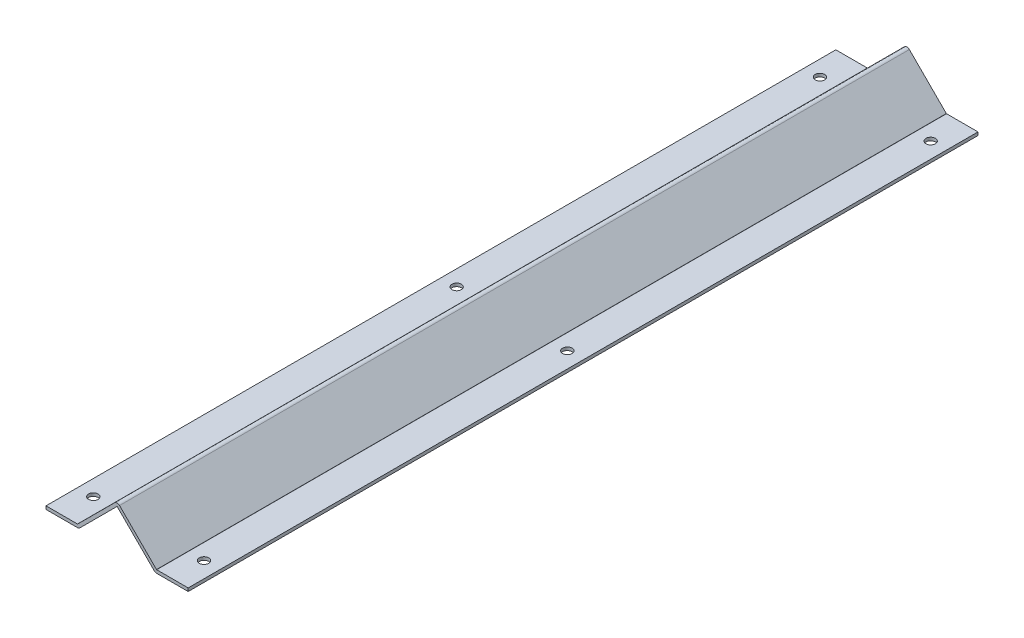
ISO-10303-21;
HEADER;
FILE_DESCRIPTION(('STEP AP214'),'2;1');
FILE_NAME('part.step','',(''),(''),'','','');
FILE_SCHEMA(('AUTOMOTIVE_DESIGN { 1 0 10303 214 1 1 1 1 }'));
ENDSEC;
DATA;
#1=APPLICATION_CONTEXT('core data for automotive mechanical design processes');
#2=APPLICATION_PROTOCOL_DEFINITION('international standard','automotive_design',2000,#1);
#3=PRODUCT_CONTEXT('',#1,'mechanical');
#4=PRODUCT('Part','Part','',(#3));
#5=PRODUCT_RELATED_PRODUCT_CATEGORY('part','',(#4));
#6=PRODUCT_DEFINITION_FORMATION('','',#4);
#7=PRODUCT_DEFINITION_CONTEXT('part definition',#1,'design');
#8=PRODUCT_DEFINITION('design','',#6,#7);
#9=PRODUCT_DEFINITION_SHAPE('','',#8);
#10=(LENGTH_UNIT() NAMED_UNIT(*) SI_UNIT(.MILLI.,.METRE.));
#11=(NAMED_UNIT(*) PLANE_ANGLE_UNIT() SI_UNIT($,.RADIAN.));
#12=(NAMED_UNIT(*) SI_UNIT($,.STERADIAN.) SOLID_ANGLE_UNIT());
#13=UNCERTAINTY_MEASURE_WITH_UNIT(LENGTH_MEASURE(1.E-05),#10,'distance_accuracy_value','');
#14=(GEOMETRIC_REPRESENTATION_CONTEXT(3) GLOBAL_UNCERTAINTY_ASSIGNED_CONTEXT((#13)) GLOBAL_UNIT_ASSIGNED_CONTEXT((#10,
#11,#12)) REPRESENTATION_CONTEXT('',''));
#15=CARTESIAN_POINT('',(0.,0.,0.));
#16=DIRECTION('',(0.,0.,1.));
#17=DIRECTION('',(1.,0.,0.));
#18=AXIS2_PLACEMENT_3D('',#15,#16,#17);
#19=CARTESIAN_POINT('',(0.,0.,500.));
#20=DIRECTION('',(1.,0.,0.));
#21=DIRECTION('',(0.,0.,-1.));
#22=AXIS2_PLACEMENT_3D('',#19,#20,#21);
#23=PLANE('',#22);
#24=DIRECTION('',(0.,-1.,0.));
#25=VECTOR('',#24,1.);
#26=CARTESIAN_POINT('',(0.,0.,0.));
#27=LINE('',#26,#25);
#28=CARTESIAN_POINT('',(0.,0.,0.));
#29=VERTEX_POINT('',#28);
#30=CARTESIAN_POINT('',(0.,-2.,0.));
#31=VERTEX_POINT('',#30);
#32=EDGE_CURVE('E178',#29,#31,#27,.T.);
#33=ORIENTED_EDGE('',*,*,#32,.T.);
#34=DIRECTION('',(0.,0.,-1.));
#35=VECTOR('',#34,1.);
#36=CARTESIAN_POINT('',(0.,-2.,500.));
#37=LINE('',#36,#35);
#38=CARTESIAN_POINT('',(0.,-2.,500.));
#39=VERTEX_POINT('',#38);
#40=EDGE_CURVE('E11',#39,#31,#37,.T.);
#41=ORIENTED_EDGE('',*,*,#40,.F.);
#42=DIRECTION('',(0.,-1.,0.));
#43=VECTOR('',#42,1.);
#44=CARTESIAN_POINT('',(0.,0.,500.));
#45=LINE('',#44,#43);
#46=CARTESIAN_POINT('',(0.,0.,500.));
#47=VERTEX_POINT('',#46);
#48=EDGE_CURVE('E209',#47,#39,#45,.T.);
#49=ORIENTED_EDGE('',*,*,#48,.F.);
#50=DIRECTION('',(0.,0.,-1.));
#51=VECTOR('',#50,1.);
#52=CARTESIAN_POINT('',(0.,0.,500.));
#53=LINE('',#52,#51);
#54=EDGE_CURVE('E174',#47,#29,#53,.T.);
#55=ORIENTED_EDGE('',*,*,#54,.T.);
#56=EDGE_LOOP('',(#33,#41,#49,#55));
#57=FACE_BOUND('',#56,.T.);
#58=ADVANCED_FACE('F34',(#57),#23,.F.);
#59=CARTESIAN_POINT('',(0.,-2.,500.));
#60=DIRECTION('',(0.,1.,0.));
#61=DIRECTION('',(0.,0.,1.));
#62=AXIS2_PLACEMENT_3D('',#59,#60,#61);
#63=PLANE('',#62);
#64=CARTESIAN_POINT('',(9.95857864376269,-2.,480.));
#65=DIRECTION('',(0.,1.,0.));
#66=DIRECTION('',(0.,0.,1.));
#67=AXIS2_PLACEMENT_3D('',#64,#65,#66);
#68=CIRCLE('',#67,3.);
#69=CARTESIAN_POINT('',(9.95857864376269,-2.,483.));
#70=VERTEX_POINT('',#69);
#71=EDGE_CURVE('E477',#70,#70,#68,.F.);
#72=ORIENTED_EDGE('',*,*,#71,.F.);
#73=EDGE_LOOP('',(#72));
#74=FACE_BOUND('',#73,.T.);
#75=CARTESIAN_POINT('',(9.95857864376269,-2.,250.));
#76=DIRECTION('',(0.,1.,0.));
#77=DIRECTION('',(0.,0.,1.));
#78=AXIS2_PLACEMENT_3D('',#75,#76,#77);
#79=CIRCLE('',#78,3.);
#80=CARTESIAN_POINT('',(9.95857864376269,-2.,253.));
#81=VERTEX_POINT('',#80);
#82=EDGE_CURVE('E475',#81,#81,#79,.F.);
#83=ORIENTED_EDGE('',*,*,#82,.F.);
#84=EDGE_LOOP('',(#83));
#85=FACE_BOUND('',#84,.T.);
#86=CARTESIAN_POINT('',(9.95857864376269,-2.,20.));
#87=DIRECTION('',(0.,1.,0.));
#88=DIRECTION('',(0.,0.,1.));
#89=AXIS2_PLACEMENT_3D('',#86,#87,#88);
#90=CIRCLE('',#89,3.);
#91=CARTESIAN_POINT('',(9.95857864376269,-2.,23.));
#92=VERTEX_POINT('',#91);
#93=EDGE_CURVE('E182',#92,#92,#90,.F.);
#94=ORIENTED_EDGE('',*,*,#93,.F.);
#95=EDGE_LOOP('',(#94));
#96=FACE_BOUND('',#95,.T.);
#97=DIRECTION('',(1.,0.,0.));
#98=VECTOR('',#97,1.);
#99=CARTESIAN_POINT('',(0.,-2.,0.));
#100=LINE('',#99,#98);
#101=CARTESIAN_POINT('',(19.9171572875254,-2.,0.));
#102=VERTEX_POINT('',#101);
#103=EDGE_CURVE('E181',#31,#102,#100,.T.);
#104=ORIENTED_EDGE('',*,*,#103,.T.);
#105=DIRECTION('',(0.,0.,-1.));
#106=VECTOR('',#105,1.);
#107=CARTESIAN_POINT('',(19.9171572875254,-2.,500.));
#108=LINE('',#107,#106);
#109=CARTESIAN_POINT('',(19.9171572875254,-2.,500.));
#110=VERTEX_POINT('',#109);
#111=EDGE_CURVE('E42',#110,#102,#108,.T.);
#112=ORIENTED_EDGE('',*,*,#111,.F.);
#113=DIRECTION('',(1.,0.,0.));
#114=VECTOR('',#113,1.);
#115=CARTESIAN_POINT('',(0.,-2.,500.));
#116=LINE('',#115,#114);
#117=EDGE_CURVE('E117',#39,#110,#116,.T.);
#118=ORIENTED_EDGE('',*,*,#117,.F.);
#119=ORIENTED_EDGE('',*,*,#40,.T.);
#120=EDGE_LOOP('',(#104,#112,#118,#119));
#121=FACE_BOUND('',#120,.T.);
#122=ADVANCED_FACE('F310',(#74,#85,#96,#121),#63,.F.);
#123=CARTESIAN_POINT('',(19.9171572875254,0.2,500.));
#124=DIRECTION('',(0.,0.,-1.));
#125=DIRECTION('',(-1.,0.,0.));
#126=AXIS2_PLACEMENT_3D('',#123,#124,#125);
#127=CYLINDRICAL_SURFACE('',#126,2.2);
#128=CARTESIAN_POINT('',(19.9171572875254,0.2,0.));
#129=DIRECTION('',(0.,0.,1.));
#130=DIRECTION('',(-1.,0.,0.));
#131=AXIS2_PLACEMENT_3D('',#128,#129,#130);
#132=CIRCLE('',#131,2.2);
#133=CARTESIAN_POINT('',(21.4727922061358,-1.35563491861041,0.));
#134=VERTEX_POINT('',#133);
#135=EDGE_CURVE('E184',#102,#134,#132,.T.);
#136=ORIENTED_EDGE('',*,*,#135,.T.);
#137=DIRECTION('',(0.,0.,-1.));
#138=VECTOR('',#137,1.);
#139=CARTESIAN_POINT('',(21.4727922061358,-1.35563491861041,500.));
#140=LINE('',#139,#138);
#141=CARTESIAN_POINT('',(21.4727922061358,-1.35563491861041,500.));
#142=VERTEX_POINT('',#141);
#143=EDGE_CURVE('E240',#142,#134,#140,.T.);
#144=ORIENTED_EDGE('',*,*,#143,.F.);
#145=CARTESIAN_POINT('',(19.9171572875254,0.2,500.));
#146=DIRECTION('',(0.,0.,1.));
#147=DIRECTION('',(-1.,0.,0.));
#148=AXIS2_PLACEMENT_3D('',#145,#146,#147);
#149=CIRCLE('',#148,2.2);
#150=EDGE_CURVE('E248',#110,#142,#149,.T.);
#151=ORIENTED_EDGE('',*,*,#150,.F.);
#152=ORIENTED_EDGE('',*,*,#111,.T.);
#153=EDGE_LOOP('',(#136,#144,#151,#152));
#154=FACE_BOUND('',#153,.T.);
#155=ADVANCED_FACE('F246',(#154),#127,.T.);
#156=CARTESIAN_POINT('',(21.4727922061358,-1.35563491861041,500.));
#157=DIRECTION('',(-0.707106781186548,0.707106781186547,0.));
#158=DIRECTION('',(-0.707106781186547,-0.707106781186548,0.));
#159=AXIS2_PLACEMENT_3D('',#156,#157,#158);
#160=PLANE('',#159);
#161=DIRECTION('',(0.707106781186548,0.707106781186548,0.));
#162=VECTOR('',#161,1.);
#163=CARTESIAN_POINT('',(21.4727922061358,-1.35563491861041,0.));
#164=LINE('',#163,#162);
#165=CARTESIAN_POINT('',(44.8585786437626,22.0301515190165,0.));
#166=VERTEX_POINT('',#165);
#167=EDGE_CURVE('E186',#134,#166,#164,.T.);
#168=ORIENTED_EDGE('',*,*,#167,.T.);
#169=DIRECTION('',(0.,0.,-1.));
#170=VECTOR('',#169,1.);
#171=CARTESIAN_POINT('',(44.8585786437626,22.0301515190165,500.));
#172=LINE('',#171,#170);
#173=CARTESIAN_POINT('',(44.8585786437626,22.0301515190165,500.));
#174=VERTEX_POINT('',#173);
#175=EDGE_CURVE('E237',#174,#166,#172,.T.);
#176=ORIENTED_EDGE('',*,*,#175,.F.);
#177=DIRECTION('',(0.707106781186548,0.707106781186548,0.));
#178=VECTOR('',#177,1.);
#179=CARTESIAN_POINT('',(21.4727922061358,-1.35563491861041,500.));
#180=LINE('',#179,#178);
#181=EDGE_CURVE('E266',#142,#174,#180,.T.);
#182=ORIENTED_EDGE('',*,*,#181,.F.);
#183=ORIENTED_EDGE('',*,*,#143,.T.);
#184=EDGE_LOOP('',(#168,#176,#182,#183));
#185=FACE_BOUND('',#184,.T.);
#186=ADVANCED_FACE('F257',(#185),#160,.F.);
#187=CARTESIAN_POINT('',(44.9999999999999,21.8887301627792,500.));
#188=DIRECTION('',(0.,0.,-1.));
#189=DIRECTION('',(-1.,0.,0.));
#190=AXIS2_PLACEMENT_3D('',#187,#188,#189);
#191=CYLINDRICAL_SURFACE('',#190,0.199999999999971);
#192=CARTESIAN_POINT('',(44.9999999999999,21.8887301627792,0.));
#193=DIRECTION('',(0.,0.,-1.));
#194=DIRECTION('',(1.,0.,0.));
#195=AXIS2_PLACEMENT_3D('',#192,#193,#194);
#196=CIRCLE('',#195,0.199999999999971);
#197=CARTESIAN_POINT('',(45.1414213562372,22.0301515190165,0.));
#198=VERTEX_POINT('',#197);
#199=EDGE_CURVE('E188',#166,#198,#196,.T.);
#200=ORIENTED_EDGE('',*,*,#199,.T.);
#201=DIRECTION('',(0.,0.,-1.));
#202=VECTOR('',#201,1.);
#203=CARTESIAN_POINT('',(45.1414213562372,22.0301515190165,500.));
#204=LINE('',#203,#202);
#205=CARTESIAN_POINT('',(45.1414213562372,22.0301515190165,500.));
#206=VERTEX_POINT('',#205);
#207=EDGE_CURVE('E234',#206,#198,#204,.T.);
#208=ORIENTED_EDGE('',*,*,#207,.F.);
#209=CARTESIAN_POINT('',(44.9999999999999,21.8887301627792,500.));
#210=DIRECTION('',(0.,0.,-1.));
#211=DIRECTION('',(1.,0.,0.));
#212=AXIS2_PLACEMENT_3D('',#209,#210,#211);
#213=CIRCLE('',#212,0.199999999999971);
#214=EDGE_CURVE('E263',#174,#206,#213,.T.);
#215=ORIENTED_EDGE('',*,*,#214,.F.);
#216=ORIENTED_EDGE('',*,*,#175,.T.);
#217=EDGE_LOOP('',(#200,#208,#215,#216));
#218=FACE_BOUND('',#217,.T.);
#219=ADVANCED_FACE('F261',(#218),#191,.F.);
#220=CARTESIAN_POINT('',(45.1414213562372,22.0301515190165,500.));
#221=DIRECTION('',(0.707106781186547,0.707106781186548,0.));
#222=DIRECTION('',(-0.707106781186548,0.707106781186547,0.));
#223=AXIS2_PLACEMENT_3D('',#220,#221,#222);
#224=PLANE('',#223);
#225=DIRECTION('',(0.707106781186548,-0.707106781186548,0.));
#226=VECTOR('',#225,1.);
#227=CARTESIAN_POINT('',(45.1414213562372,22.0301515190165,0.));
#228=LINE('',#227,#226);
#229=CARTESIAN_POINT('',(68.5272077938641,-1.35563491861039,0.));
#230=VERTEX_POINT('',#229);
#231=EDGE_CURVE('E190',#198,#230,#228,.T.);
#232=ORIENTED_EDGE('',*,*,#231,.T.);
#233=DIRECTION('',(0.,0.,-1.));
#234=VECTOR('',#233,1.);
#235=CARTESIAN_POINT('',(68.5272077938641,-1.35563491861039,500.));
#236=LINE('',#235,#234);
#237=CARTESIAN_POINT('',(68.5272077938641,-1.35563491861039,500.));
#238=VERTEX_POINT('',#237);
#239=EDGE_CURVE('E231',#238,#230,#236,.T.);
#240=ORIENTED_EDGE('',*,*,#239,.F.);
#241=DIRECTION('',(0.707106781186548,-0.707106781186548,0.));
#242=VECTOR('',#241,1.);
#243=CARTESIAN_POINT('',(45.1414213562372,22.0301515190165,500.));
#244=LINE('',#243,#242);
#245=EDGE_CURVE('E265',#206,#238,#244,.T.);
#246=ORIENTED_EDGE('',*,*,#245,.F.);
#247=ORIENTED_EDGE('',*,*,#207,.T.);
#248=EDGE_LOOP('',(#232,#240,#246,#247));
#249=FACE_BOUND('',#248,.T.);
#250=ADVANCED_FACE('F326',(#249),#224,.F.);
#251=CARTESIAN_POINT('',(70.0828427124744,0.199999999999999,500.));
#252=DIRECTION('',(0.,0.,-1.));
#253=DIRECTION('',(-1.,0.,0.));
#254=AXIS2_PLACEMENT_3D('',#251,#252,#253);
#255=CYLINDRICAL_SURFACE('',#254,2.19999999999997);
#256=CARTESIAN_POINT('',(70.0828427124744,0.199999999999999,0.));
#257=DIRECTION('',(0.,0.,1.));
#258=DIRECTION('',(1.,0.,0.));
#259=AXIS2_PLACEMENT_3D('',#256,#257,#258);
#260=CIRCLE('',#259,2.19999999999997);
#261=CARTESIAN_POINT('',(70.0828427124744,-2.,0.));
#262=VERTEX_POINT('',#261);
#263=EDGE_CURVE('E192',#230,#262,#260,.T.);
#264=ORIENTED_EDGE('',*,*,#263,.T.);
#265=DIRECTION('',(0.,0.,-1.));
#266=VECTOR('',#265,1.);
#267=CARTESIAN_POINT('',(70.0828427124744,-2.,500.));
#268=LINE('',#267,#266);
#269=CARTESIAN_POINT('',(70.0828427124744,-2.,500.));
#270=VERTEX_POINT('',#269);
#271=EDGE_CURVE('E228',#270,#262,#268,.T.);
#272=ORIENTED_EDGE('',*,*,#271,.F.);
#273=CARTESIAN_POINT('',(70.0828427124744,0.199999999999999,500.));
#274=DIRECTION('',(0.,0.,1.));
#275=DIRECTION('',(1.,0.,0.));
#276=AXIS2_PLACEMENT_3D('',#273,#274,#275);
#277=CIRCLE('',#276,2.19999999999997);
#278=EDGE_CURVE('E268',#238,#270,#277,.T.);
#279=ORIENTED_EDGE('',*,*,#278,.F.);
#280=ORIENTED_EDGE('',*,*,#239,.T.);
#281=EDGE_LOOP('',(#264,#272,#279,#280));
#282=FACE_BOUND('',#281,.T.);
#283=ADVANCED_FACE('F329',(#282),#255,.T.);
#284=CARTESIAN_POINT('',(70.0828427124744,-2.,500.));
#285=DIRECTION('',(0.,1.,0.));
#286=DIRECTION('',(-1.,0.,0.));
#287=AXIS2_PLACEMENT_3D('',#284,#285,#286);
#288=PLANE('',#287);
#289=CARTESIAN_POINT('',(80.0414213562371,-2.,250.));
#290=DIRECTION('',(0.,1.,0.));
#291=DIRECTION('',(-1.,0.,0.));
#292=AXIS2_PLACEMENT_3D('',#289,#290,#291);
#293=CIRCLE('',#292,3.00000000000001);
#294=CARTESIAN_POINT('',(77.0414213562371,-2.,250.));
#295=VERTEX_POINT('',#294);
#296=EDGE_CURVE('E471',#295,#295,#293,.F.);
#297=ORIENTED_EDGE('',*,*,#296,.F.);
#298=EDGE_LOOP('',(#297));
#299=FACE_BOUND('',#298,.T.);
#300=CARTESIAN_POINT('',(80.0414213562371,-2.,20.));
#301=DIRECTION('',(0.,1.,0.));
#302=DIRECTION('',(-1.,0.,0.));
#303=AXIS2_PLACEMENT_3D('',#300,#301,#302);
#304=CIRCLE('',#303,3.00000000000001);
#305=CARTESIAN_POINT('',(77.0414213562371,-2.,20.));
#306=VERTEX_POINT('',#305);
#307=EDGE_CURVE('E490',#306,#306,#304,.F.);
#308=ORIENTED_EDGE('',*,*,#307,.F.);
#309=EDGE_LOOP('',(#308));
#310=FACE_BOUND('',#309,.T.);
#311=CARTESIAN_POINT('',(80.0414213562371,-2.,480.));
#312=DIRECTION('',(0.,1.,0.));
#313=DIRECTION('',(-1.,0.,0.));
#314=AXIS2_PLACEMENT_3D('',#311,#312,#313);
#315=CIRCLE('',#314,3.00000000000001);
#316=CARTESIAN_POINT('',(77.0414213562371,-2.,480.));
#317=VERTEX_POINT('',#316);
#318=EDGE_CURVE('E484',#317,#317,#315,.F.);
#319=ORIENTED_EDGE('',*,*,#318,.F.);
#320=EDGE_LOOP('',(#319));
#321=FACE_BOUND('',#320,.T.);
#322=DIRECTION('',(1.,0.,0.));
#323=VECTOR('',#322,1.);
#324=CARTESIAN_POINT('',(70.0828427124744,-2.,0.));
#325=LINE('',#324,#323);
#326=CARTESIAN_POINT('',(89.9999999999998,-2.,0.));
#327=VERTEX_POINT('',#326);
#328=EDGE_CURVE('E194',#262,#327,#325,.T.);
#329=ORIENTED_EDGE('',*,*,#328,.T.);
#330=DIRECTION('',(0.,0.,-1.));
#331=VECTOR('',#330,1.);
#332=CARTESIAN_POINT('',(89.9999999999998,-2.,500.));
#333=LINE('',#332,#331);
#334=CARTESIAN_POINT('',(89.9999999999998,-2.,500.));
#335=VERTEX_POINT('',#334);
#336=EDGE_CURVE('E225',#335,#327,#333,.T.);
#337=ORIENTED_EDGE('',*,*,#336,.F.);
#338=DIRECTION('',(1.,0.,0.));
#339=VECTOR('',#338,1.);
#340=CARTESIAN_POINT('',(70.0828427124744,-2.,500.));
#341=LINE('',#340,#339);
#342=EDGE_CURVE('E274',#270,#335,#341,.T.);
#343=ORIENTED_EDGE('',*,*,#342,.F.);
#344=ORIENTED_EDGE('',*,*,#271,.T.);
#345=EDGE_LOOP('',(#329,#337,#343,#344));
#346=FACE_BOUND('',#345,.T.);
#347=ADVANCED_FACE('F333',(#299,#310,#321,#346),#288,.F.);
#348=CARTESIAN_POINT('',(89.9999999999998,0.,500.));
#349=DIRECTION('',(-1.,0.,0.));
#350=DIRECTION('',(0.,0.,1.));
#351=AXIS2_PLACEMENT_3D('',#348,#349,#350);
#352=PLANE('',#351);
#353=DIRECTION('',(0.,1.,0.));
#354=VECTOR('',#353,1.);
#355=CARTESIAN_POINT('',(89.9999999999998,0.,0.));
#356=LINE('',#355,#354);
#357=CARTESIAN_POINT('',(89.9999999999998,0.,0.));
#358=VERTEX_POINT('',#357);
#359=EDGE_CURVE('E196',#327,#358,#356,.T.);
#360=ORIENTED_EDGE('',*,*,#359,.T.);
#361=DIRECTION('',(0.,0.,-1.));
#362=VECTOR('',#361,1.);
#363=CARTESIAN_POINT('',(89.9999999999998,0.,500.));
#364=LINE('',#363,#362);
#365=CARTESIAN_POINT('',(89.9999999999998,0.,500.));
#366=VERTEX_POINT('',#365);
#367=EDGE_CURVE('E222',#366,#358,#364,.T.);
#368=ORIENTED_EDGE('',*,*,#367,.F.);
#369=DIRECTION('',(0.,1.,0.));
#370=VECTOR('',#369,1.);
#371=CARTESIAN_POINT('',(89.9999999999998,0.,500.));
#372=LINE('',#371,#370);
#373=EDGE_CURVE('E276',#335,#366,#372,.T.);
#374=ORIENTED_EDGE('',*,*,#373,.F.);
#375=ORIENTED_EDGE('',*,*,#336,.T.);
#376=EDGE_LOOP('',(#360,#368,#374,#375));
#377=FACE_BOUND('',#376,.T.);
#378=ADVANCED_FACE('F337',(#377),#352,.F.);
#379=CARTESIAN_POINT('',(70.0828427124744,0.,500.));
#380=DIRECTION('',(0.,-1.,0.));
#381=DIRECTION('',(0.,0.,-1.));
#382=AXIS2_PLACEMENT_3D('',#379,#380,#381);
#383=PLANE('',#382);
#384=CARTESIAN_POINT('',(80.0414213562371,0.,250.));
#385=DIRECTION('',(0.,1.,0.));
#386=DIRECTION('',(0.,0.,1.));
#387=AXIS2_PLACEMENT_3D('',#384,#385,#386);
#388=CIRCLE('',#387,3.00000000000001);
#389=CARTESIAN_POINT('',(80.0414213562371,0.,253.));
#390=VERTEX_POINT('',#389);
#391=EDGE_CURVE('E468',#390,#390,#388,.T.);
#392=ORIENTED_EDGE('',*,*,#391,.F.);
#393=EDGE_LOOP('',(#392));
#394=FACE_BOUND('',#393,.T.);
#395=CARTESIAN_POINT('',(80.0414213562371,0.,20.));
#396=DIRECTION('',(0.,1.,0.));
#397=DIRECTION('',(0.,0.,1.));
#398=AXIS2_PLACEMENT_3D('',#395,#396,#397);
#399=CIRCLE('',#398,3.00000000000001);
#400=CARTESIAN_POINT('',(80.0414213562371,0.,23.));
#401=VERTEX_POINT('',#400);
#402=EDGE_CURVE('E487',#401,#401,#399,.T.);
#403=ORIENTED_EDGE('',*,*,#402,.F.);
#404=EDGE_LOOP('',(#403));
#405=FACE_BOUND('',#404,.T.);
#406=CARTESIAN_POINT('',(80.0414213562371,0.,480.));
#407=DIRECTION('',(0.,1.,0.));
#408=DIRECTION('',(0.,0.,1.));
#409=AXIS2_PLACEMENT_3D('',#406,#407,#408);
#410=CIRCLE('',#409,3.00000000000001);
#411=CARTESIAN_POINT('',(80.0414213562371,0.,483.));
#412=VERTEX_POINT('',#411);
#413=EDGE_CURVE('E531',#412,#412,#410,.T.);
#414=ORIENTED_EDGE('',*,*,#413,.F.);
#415=EDGE_LOOP('',(#414));
#416=FACE_BOUND('',#415,.T.);
#417=DIRECTION('',(-1.,0.,0.));
#418=VECTOR('',#417,1.);
#419=CARTESIAN_POINT('',(70.0828427124744,0.,0.));
#420=LINE('',#419,#418);
#421=CARTESIAN_POINT('',(70.0828427124744,0.,0.));
#422=VERTEX_POINT('',#421);
#423=EDGE_CURVE('E198',#358,#422,#420,.T.);
#424=ORIENTED_EDGE('',*,*,#423,.T.);
#425=DIRECTION('',(0.,0.,-1.));
#426=VECTOR('',#425,1.);
#427=CARTESIAN_POINT('',(70.0828427124744,0.,500.));
#428=LINE('',#427,#426);
#429=CARTESIAN_POINT('',(70.0828427124744,0.,500.));
#430=VERTEX_POINT('',#429);
#431=EDGE_CURVE('E219',#430,#422,#428,.T.);
#432=ORIENTED_EDGE('',*,*,#431,.F.);
#433=DIRECTION('',(-1.,0.,0.));
#434=VECTOR('',#433,1.);
#435=CARTESIAN_POINT('',(70.0828427124744,0.,500.));
#436=LINE('',#435,#434);
#437=EDGE_CURVE('E278',#366,#430,#436,.T.);
#438=ORIENTED_EDGE('',*,*,#437,.F.);
#439=ORIENTED_EDGE('',*,*,#367,.T.);
#440=EDGE_LOOP('',(#424,#432,#438,#439));
#441=FACE_BOUND('',#440,.T.);
#442=ADVANCED_FACE('F341',(#394,#405,#416,#441),#383,.F.);
#443=CARTESIAN_POINT('',(70.0828427124744,0.2,500.));
#444=DIRECTION('',(0.,0.,-1.));
#445=DIRECTION('',(-1.,0.,0.));
#446=AXIS2_PLACEMENT_3D('',#443,#444,#445);
#447=CYLINDRICAL_SURFACE('',#446,0.2);
#448=CARTESIAN_POINT('',(70.0828427124744,0.2,0.));
#449=DIRECTION('',(0.,0.,-1.));
#450=DIRECTION('',(1.,0.,0.));
#451=AXIS2_PLACEMENT_3D('',#448,#449,#450);
#452=CIRCLE('',#451,0.2);
#453=CARTESIAN_POINT('',(69.9414213562371,0.058578643762688,0.));
#454=VERTEX_POINT('',#453);
#455=EDGE_CURVE('E200',#422,#454,#452,.T.);
#456=ORIENTED_EDGE('',*,*,#455,.T.);
#457=DIRECTION('',(0.,0.,-1.));
#458=VECTOR('',#457,1.);
#459=CARTESIAN_POINT('',(69.9414213562371,0.058578643762688,500.));
#460=LINE('',#459,#458);
#461=CARTESIAN_POINT('',(69.9414213562371,0.058578643762688,500.));
#462=VERTEX_POINT('',#461);
#463=EDGE_CURVE('E216',#462,#454,#460,.T.);
#464=ORIENTED_EDGE('',*,*,#463,.F.);
#465=CARTESIAN_POINT('',(70.0828427124744,0.2,500.));
#466=DIRECTION('',(0.,0.,-1.));
#467=DIRECTION('',(1.,0.,0.));
#468=AXIS2_PLACEMENT_3D('',#465,#466,#467);
#469=CIRCLE('',#468,0.2);
#470=EDGE_CURVE('E280',#430,#462,#469,.T.);
#471=ORIENTED_EDGE('',*,*,#470,.F.);
#472=ORIENTED_EDGE('',*,*,#431,.T.);
#473=EDGE_LOOP('',(#456,#464,#471,#472));
#474=FACE_BOUND('',#473,.T.);
#475=ADVANCED_FACE('F345',(#474),#447,.F.);
#476=CARTESIAN_POINT('',(46.5556349186103,23.4443650813896,500.));
#477=DIRECTION('',(-0.707106781186549,-0.707106781186546,0.));
#478=DIRECTION('',(0.707106781186546,-0.707106781186549,0.));
#479=AXIS2_PLACEMENT_3D('',#476,#477,#478);
#480=PLANE('',#479);
#481=DIRECTION('',(-0.707106781186546,0.707106781186549,0.));
#482=VECTOR('',#481,1.);
#483=CARTESIAN_POINT('',(46.5556349186103,23.4443650813896,0.));
#484=LINE('',#483,#482);
#485=CARTESIAN_POINT('',(46.5556349186103,23.4443650813896,0.));
#486=VERTEX_POINT('',#485);
#487=EDGE_CURVE('E202',#454,#486,#484,.T.);
#488=ORIENTED_EDGE('',*,*,#487,.T.);
#489=DIRECTION('',(0.,0.,-1.));
#490=VECTOR('',#489,1.);
#491=CARTESIAN_POINT('',(46.5556349186103,23.4443650813896,500.));
#492=LINE('',#491,#490);
#493=CARTESIAN_POINT('',(46.5556349186103,23.4443650813896,500.));
#494=VERTEX_POINT('',#493);
#495=EDGE_CURVE('E213',#494,#486,#492,.T.);
#496=ORIENTED_EDGE('',*,*,#495,.F.);
#497=DIRECTION('',(-0.707106781186546,0.707106781186549,0.));
#498=VECTOR('',#497,1.);
#499=CARTESIAN_POINT('',(46.5556349186103,23.4443650813896,500.));
#500=LINE('',#499,#498);
#501=EDGE_CURVE('E282',#462,#494,#500,.T.);
#502=ORIENTED_EDGE('',*,*,#501,.F.);
#503=ORIENTED_EDGE('',*,*,#463,.T.);
#504=EDGE_LOOP('',(#488,#496,#502,#503));
#505=FACE_BOUND('',#504,.T.);
#506=ADVANCED_FACE('F288',(#505),#480,.F.);
#507=CARTESIAN_POINT('',(44.9999999999999,21.8887301627792,500.));
#508=DIRECTION('',(0.,0.,-1.));
#509=DIRECTION('',(-1.,0.,0.));
#510=AXIS2_PLACEMENT_3D('',#507,#508,#509);
#511=CYLINDRICAL_SURFACE('',#510,2.2);
#512=CARTESIAN_POINT('',(44.9999999999999,21.8887301627792,0.));
#513=DIRECTION('',(0.,0.,1.));
#514=DIRECTION('',(1.,0.,0.));
#515=AXIS2_PLACEMENT_3D('',#512,#513,#514);
#516=CIRCLE('',#515,2.2);
#517=CARTESIAN_POINT('',(43.4443650813895,23.4443650813896,0.));
#518=VERTEX_POINT('',#517);
#519=EDGE_CURVE('E204',#486,#518,#516,.T.);
#520=ORIENTED_EDGE('',*,*,#519,.T.);
#521=DIRECTION('',(0.,0.,-1.));
#522=VECTOR('',#521,1.);
#523=CARTESIAN_POINT('',(43.4443650813895,23.4443650813896,500.));
#524=LINE('',#523,#522);
#525=CARTESIAN_POINT('',(43.4443650813895,23.4443650813896,500.));
#526=VERTEX_POINT('',#525);
#527=EDGE_CURVE('E169',#526,#518,#524,.T.);
#528=ORIENTED_EDGE('',*,*,#527,.F.);
#529=CARTESIAN_POINT('',(44.9999999999999,21.8887301627792,500.));
#530=DIRECTION('',(0.,0.,1.));
#531=DIRECTION('',(1.,0.,0.));
#532=AXIS2_PLACEMENT_3D('',#529,#530,#531);
#533=CIRCLE('',#532,2.2);
#534=EDGE_CURVE('E160',#494,#526,#533,.T.);
#535=ORIENTED_EDGE('',*,*,#534,.F.);
#536=ORIENTED_EDGE('',*,*,#495,.T.);
#537=EDGE_LOOP('',(#520,#528,#535,#536));
#538=FACE_BOUND('',#537,.T.);
#539=ADVANCED_FACE('F292',(#538),#511,.T.);
#540=CARTESIAN_POINT('',(20.0585786437627,0.0585786437626896,500.));
#541=DIRECTION('',(0.707106781186549,-0.707106781186546,0.));
#542=DIRECTION('',(0.707106781186546,0.707106781186549,0.));
#543=AXIS2_PLACEMENT_3D('',#540,#541,#542);
#544=PLANE('',#543);
#545=DIRECTION('',(-0.707106781186546,-0.707106781186549,0.));
#546=VECTOR('',#545,1.);
#547=CARTESIAN_POINT('',(20.0585786437627,0.0585786437626896,0.));
#548=LINE('',#547,#546);
#549=CARTESIAN_POINT('',(20.0585786437627,0.0585786437626913,0.));
#550=VERTEX_POINT('',#549);
#551=EDGE_CURVE('E168',#518,#550,#548,.T.);
#552=ORIENTED_EDGE('',*,*,#551,.T.);
#553=DIRECTION('',(0.,0.,-1.));
#554=VECTOR('',#553,1.);
#555=CARTESIAN_POINT('',(20.0585786437627,0.0585786437626913,500.));
#556=LINE('',#555,#554);
#557=CARTESIAN_POINT('',(20.0585786437627,0.0585786437626913,500.));
#558=VERTEX_POINT('',#557);
#559=EDGE_CURVE('E165',#558,#550,#556,.T.);
#560=ORIENTED_EDGE('',*,*,#559,.F.);
#561=DIRECTION('',(-0.707106781186546,-0.707106781186549,0.));
#562=VECTOR('',#561,1.);
#563=CARTESIAN_POINT('',(20.0585786437627,0.0585786437626896,500.));
#564=LINE('',#563,#562);
#565=EDGE_CURVE('E154',#526,#558,#564,.T.);
#566=ORIENTED_EDGE('',*,*,#565,.F.);
#567=ORIENTED_EDGE('',*,*,#527,.T.);
#568=EDGE_LOOP('',(#552,#560,#566,#567));
#569=FACE_BOUND('',#568,.T.);
#570=ADVANCED_FACE('F166',(#569),#544,.F.);
#571=CARTESIAN_POINT('',(19.9171572875254,0.2,500.));
#572=DIRECTION('',(0.,0.,-1.));
#573=DIRECTION('',(-1.,0.,0.));
#574=AXIS2_PLACEMENT_3D('',#571,#572,#573);
#575=CYLINDRICAL_SURFACE('',#574,0.200000000000002);
#576=CARTESIAN_POINT('',(19.9171572875254,0.2,0.));
#577=DIRECTION('',(0.,0.,-1.));
#578=DIRECTION('',(-1.,0.,0.));
#579=AXIS2_PLACEMENT_3D('',#576,#577,#578);
#580=CIRCLE('',#579,0.200000000000002);
#581=CARTESIAN_POINT('',(19.9171572875254,0.,0.));
#582=VERTEX_POINT('',#581);
#583=EDGE_CURVE('E103',#550,#582,#580,.T.);
#584=ORIENTED_EDGE('',*,*,#583,.T.);
#585=DIRECTION('',(0.,0.,-1.));
#586=VECTOR('',#585,1.);
#587=CARTESIAN_POINT('',(19.9171572875254,0.,500.));
#588=LINE('',#587,#586);
#589=CARTESIAN_POINT('',(19.9171572875254,0.,500.));
#590=VERTEX_POINT('',#589);
#591=EDGE_CURVE('E170',#590,#582,#588,.T.);
#592=ORIENTED_EDGE('',*,*,#591,.F.);
#593=CARTESIAN_POINT('',(19.9171572875254,0.2,500.));
#594=DIRECTION('',(0.,0.,-1.));
#595=DIRECTION('',(-1.,0.,0.));
#596=AXIS2_PLACEMENT_3D('',#593,#594,#595);
#597=CIRCLE('',#596,0.200000000000002);
#598=EDGE_CURVE('E158',#558,#590,#597,.T.);
#599=ORIENTED_EDGE('',*,*,#598,.F.);
#600=ORIENTED_EDGE('',*,*,#559,.T.);
#601=EDGE_LOOP('',(#584,#592,#599,#600));
#602=FACE_BOUND('',#601,.T.);
#603=ADVANCED_FACE('F172',(#602),#575,.F.);
#604=CARTESIAN_POINT('',(0.,0.,500.));
#605=DIRECTION('',(0.,-1.,0.));
#606=DIRECTION('',(0.,0.,-1.));
#607=AXIS2_PLACEMENT_3D('',#604,#605,#606);
#608=PLANE('',#607);
#609=CARTESIAN_POINT('',(9.95857864376269,0.,480.));
#610=DIRECTION('',(0.,1.,0.));
#611=DIRECTION('',(0.,0.,1.));
#612=AXIS2_PLACEMENT_3D('',#609,#610,#611);
#613=CIRCLE('',#612,3.);
#614=CARTESIAN_POINT('',(9.95857864376269,0.,483.));
#615=VERTEX_POINT('',#614);
#616=EDGE_CURVE('E481',#615,#615,#613,.T.);
#617=ORIENTED_EDGE('',*,*,#616,.F.);
#618=EDGE_LOOP('',(#617));
#619=FACE_BOUND('',#618,.T.);
#620=CARTESIAN_POINT('',(9.95857864376269,0.,250.));
#621=DIRECTION('',(0.,1.,0.));
#622=DIRECTION('',(0.,0.,1.));
#623=AXIS2_PLACEMENT_3D('',#620,#621,#622);
#624=CIRCLE('',#623,3.);
#625=CARTESIAN_POINT('',(9.95857864376269,0.,253.));
#626=VERTEX_POINT('',#625);
#627=EDGE_CURVE('E472',#626,#626,#624,.T.);
#628=ORIENTED_EDGE('',*,*,#627,.F.);
#629=EDGE_LOOP('',(#628));
#630=FACE_BOUND('',#629,.T.);
#631=CARTESIAN_POINT('',(9.95857864376269,0.,20.));
#632=DIRECTION('',(0.,1.,0.));
#633=DIRECTION('',(0.,0.,1.));
#634=AXIS2_PLACEMENT_3D('',#631,#632,#633);
#635=CIRCLE('',#634,3.);
#636=CARTESIAN_POINT('',(9.95857864376269,0.,23.));
#637=VERTEX_POINT('',#636);
#638=EDGE_CURVE('E492',#637,#637,#635,.T.);
#639=ORIENTED_EDGE('',*,*,#638,.F.);
#640=EDGE_LOOP('',(#639));
#641=FACE_BOUND('',#640,.T.);
#642=DIRECTION('',(-1.,0.,0.));
#643=VECTOR('',#642,1.);
#644=CARTESIAN_POINT('',(0.,0.,0.));
#645=LINE('',#644,#643);
#646=EDGE_CURVE('E109',#582,#29,#645,.T.);
#647=ORIENTED_EDGE('',*,*,#646,.T.);
#648=ORIENTED_EDGE('',*,*,#54,.F.);
#649=DIRECTION('',(-1.,0.,0.));
#650=VECTOR('',#649,1.);
#651=CARTESIAN_POINT('',(0.,0.,500.));
#652=LINE('',#651,#650);
#653=EDGE_CURVE('E50',#590,#47,#652,.T.);
#654=ORIENTED_EDGE('',*,*,#653,.F.);
#655=ORIENTED_EDGE('',*,*,#591,.T.);
#656=EDGE_LOOP('',(#647,#648,#654,#655));
#657=FACE_BOUND('',#656,.T.);
#658=ADVANCED_FACE('F296',(#619,#630,#641,#657),#608,.F.);
#659=CARTESIAN_POINT('',(19.9171572875254,0.2,500.));
#660=DIRECTION('',(0.,0.,-1.));
#661=DIRECTION('',(-1.,0.,0.));
#662=AXIS2_PLACEMENT_3D('',#659,#660,#661);
#663=PLANE('',#662);
#664=ORIENTED_EDGE('',*,*,#48,.T.);
#665=ORIENTED_EDGE('',*,*,#117,.T.);
#666=ORIENTED_EDGE('',*,*,#150,.T.);
#667=ORIENTED_EDGE('',*,*,#181,.T.);
#668=ORIENTED_EDGE('',*,*,#214,.T.);
#669=ORIENTED_EDGE('',*,*,#245,.T.);
#670=ORIENTED_EDGE('',*,*,#278,.T.);
#671=ORIENTED_EDGE('',*,*,#342,.T.);
#672=ORIENTED_EDGE('',*,*,#373,.T.);
#673=ORIENTED_EDGE('',*,*,#437,.T.);
#674=ORIENTED_EDGE('',*,*,#470,.T.);
#675=ORIENTED_EDGE('',*,*,#501,.T.);
#676=ORIENTED_EDGE('',*,*,#534,.T.);
#677=ORIENTED_EDGE('',*,*,#565,.T.);
#678=ORIENTED_EDGE('',*,*,#598,.T.);
#679=ORIENTED_EDGE('',*,*,#653,.T.);
#680=EDGE_LOOP('',(#664,#665,#666,#667,#668,#669,#670,#671,#672,#673,#674,#675,#676,#677,#678,#679));
#681=FACE_BOUND('',#680,.T.);
#682=ADVANCED_FACE('F156',(#681),#663,.F.);
#683=CARTESIAN_POINT('',(19.9171572875254,0.2,0.));
#684=DIRECTION('',(0.,0.,-1.));
#685=DIRECTION('',(-1.,0.,0.));
#686=AXIS2_PLACEMENT_3D('',#683,#684,#685);
#687=PLANE('',#686);
#688=ORIENTED_EDGE('',*,*,#32,.F.);
#689=ORIENTED_EDGE('',*,*,#646,.F.);
#690=ORIENTED_EDGE('',*,*,#583,.F.);
#691=ORIENTED_EDGE('',*,*,#551,.F.);
#692=ORIENTED_EDGE('',*,*,#519,.F.);
#693=ORIENTED_EDGE('',*,*,#487,.F.);
#694=ORIENTED_EDGE('',*,*,#455,.F.);
#695=ORIENTED_EDGE('',*,*,#423,.F.);
#696=ORIENTED_EDGE('',*,*,#359,.F.);
#697=ORIENTED_EDGE('',*,*,#328,.F.);
#698=ORIENTED_EDGE('',*,*,#263,.F.);
#699=ORIENTED_EDGE('',*,*,#231,.F.);
#700=ORIENTED_EDGE('',*,*,#199,.F.);
#701=ORIENTED_EDGE('',*,*,#167,.F.);
#702=ORIENTED_EDGE('',*,*,#135,.F.);
#703=ORIENTED_EDGE('',*,*,#103,.F.);
#704=EDGE_LOOP('',(#688,#689,#690,#691,#692,#693,#694,#695,#696,#697,#698,#699,#700,#701,#702,#703));
#705=FACE_BOUND('',#704,.T.);
#706=ADVANCED_FACE('F252',(#705),#687,.T.);
#707=CARTESIAN_POINT('',(9.95857864376269,-2.001,20.));
#708=DIRECTION('',(0.,1.,0.));
#709=DIRECTION('',(0.,0.,1.));
#710=AXIS2_PLACEMENT_3D('',#707,#708,#709);
#711=CYLINDRICAL_SURFACE('',#710,3.);
#712=ORIENTED_EDGE('',*,*,#638,.T.);
#713=EDGE_LOOP('',(#712));
#714=FACE_BOUND('',#713,.T.);
#715=ORIENTED_EDGE('',*,*,#93,.T.);
#716=EDGE_LOOP('',(#715));
#717=FACE_BOUND('',#716,.T.);
#718=ADVANCED_FACE('F378',(#714,#717),#711,.F.);
#719=CARTESIAN_POINT('',(9.95857864376269,-2.001,250.));
#720=DIRECTION('',(0.,1.,0.));
#721=DIRECTION('',(0.,0.,1.));
#722=AXIS2_PLACEMENT_3D('',#719,#720,#721);
#723=CYLINDRICAL_SURFACE('',#722,3.);
#724=ORIENTED_EDGE('',*,*,#627,.T.);
#725=EDGE_LOOP('',(#724));
#726=FACE_BOUND('',#725,.T.);
#727=ORIENTED_EDGE('',*,*,#82,.T.);
#728=EDGE_LOOP('',(#727));
#729=FACE_BOUND('',#728,.T.);
#730=ADVANCED_FACE('F411',(#726,#729),#723,.F.);
#731=CARTESIAN_POINT('',(9.95857864376269,-2.001,480.));
#732=DIRECTION('',(0.,1.,0.));
#733=DIRECTION('',(0.,0.,1.));
#734=AXIS2_PLACEMENT_3D('',#731,#732,#733);
#735=CYLINDRICAL_SURFACE('',#734,3.);
#736=ORIENTED_EDGE('',*,*,#616,.T.);
#737=EDGE_LOOP('',(#736));
#738=FACE_BOUND('',#737,.T.);
#739=ORIENTED_EDGE('',*,*,#71,.T.);
#740=EDGE_LOOP('',(#739));
#741=FACE_BOUND('',#740,.T.);
#742=ADVANCED_FACE('F421',(#738,#741),#735,.F.);
#743=CARTESIAN_POINT('',(80.0414213562371,-2.001,480.));
#744=DIRECTION('',(0.,1.,0.));
#745=DIRECTION('',(0.,0.,1.));
#746=AXIS2_PLACEMENT_3D('',#743,#744,#745);
#747=CYLINDRICAL_SURFACE('',#746,3.00000000000001);
#748=ORIENTED_EDGE('',*,*,#413,.T.);
#749=EDGE_LOOP('',(#748));
#750=FACE_BOUND('',#749,.T.);
#751=ORIENTED_EDGE('',*,*,#318,.T.);
#752=EDGE_LOOP('',(#751));
#753=FACE_BOUND('',#752,.T.);
#754=ADVANCED_FACE('F431',(#750,#753),#747,.F.);
#755=CARTESIAN_POINT('',(80.0414213562371,-2.001,20.));
#756=DIRECTION('',(0.,1.,0.));
#757=DIRECTION('',(0.,0.,1.));
#758=AXIS2_PLACEMENT_3D('',#755,#756,#757);
#759=CYLINDRICAL_SURFACE('',#758,3.00000000000001);
#760=ORIENTED_EDGE('',*,*,#402,.T.);
#761=EDGE_LOOP('',(#760));
#762=FACE_BOUND('',#761,.T.);
#763=ORIENTED_EDGE('',*,*,#307,.T.);
#764=EDGE_LOOP('',(#763));
#765=FACE_BOUND('',#764,.T.);
#766=ADVANCED_FACE('F441',(#762,#765),#759,.F.);
#767=CARTESIAN_POINT('',(80.0414213562371,-2.001,250.));
#768=DIRECTION('',(0.,1.,0.));
#769=DIRECTION('',(0.,0.,1.));
#770=AXIS2_PLACEMENT_3D('',#767,#768,#769);
#771=CYLINDRICAL_SURFACE('',#770,3.00000000000001);
#772=ORIENTED_EDGE('',*,*,#391,.T.);
#773=EDGE_LOOP('',(#772));
#774=FACE_BOUND('',#773,.T.);
#775=ORIENTED_EDGE('',*,*,#296,.T.);
#776=EDGE_LOOP('',(#775));
#777=FACE_BOUND('',#776,.T.);
#778=ADVANCED_FACE('F451',(#774,#777),#771,.F.);
#779=CLOSED_SHELL('',(#58,#122,#155,#186,#219,#250,#283,#347,#378,#442,#475,#506,#539,#570,#603,
#658,#682,#706,#718,#730,#742,#754,#766,#778));
#780=MANIFOLD_SOLID_BREP('B2',#779);
#781=ADVANCED_BREP_SHAPE_REPRESENTATION('',(#18,#780),#14);
#782=SHAPE_DEFINITION_REPRESENTATION(#9,#781);
ENDSEC;
END-ISO-10303-21;
